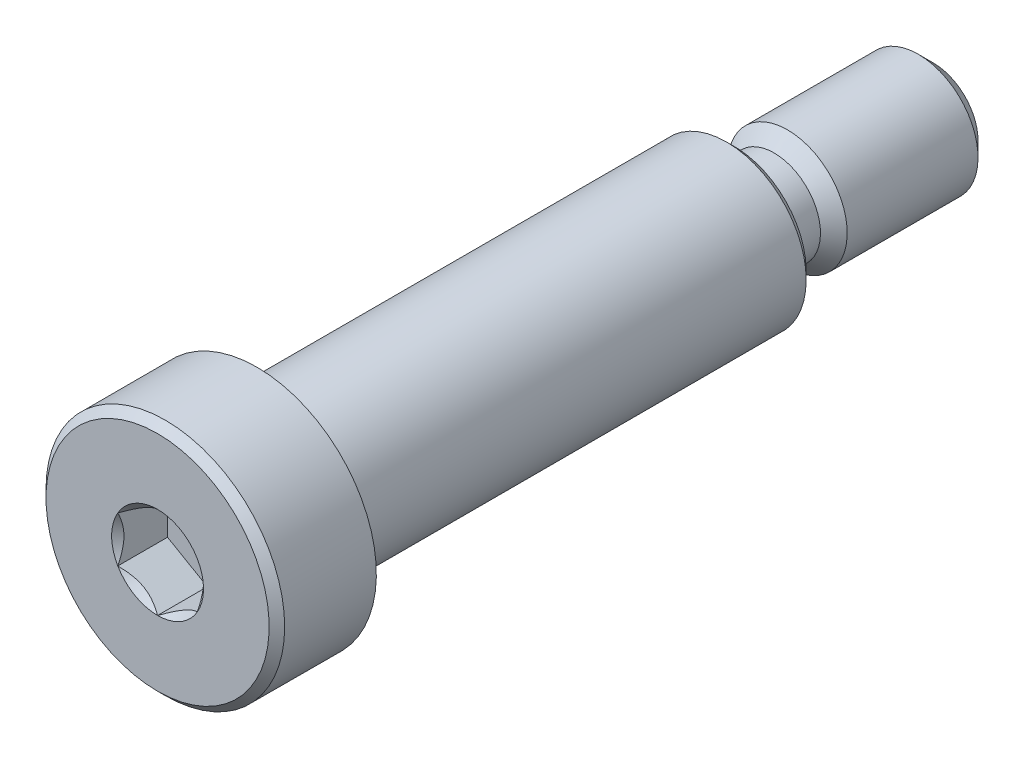
ISO-10303-21;
HEADER;
FILE_DESCRIPTION(('STEP AP214'),'2;1');
FILE_NAME('part.step','',(''),(''),'','','');
FILE_SCHEMA(('AUTOMOTIVE_DESIGN { 1 0 10303 214 1 1 1 1 }'));
ENDSEC;
DATA;
#1=APPLICATION_CONTEXT('core data for automotive mechanical design processes');
#2=APPLICATION_PROTOCOL_DEFINITION('international standard','automotive_design',2000,#1);
#3=PRODUCT_CONTEXT('',#1,'mechanical');
#4=PRODUCT('Part','Part','',(#3));
#5=PRODUCT_RELATED_PRODUCT_CATEGORY('part','',(#4));
#6=PRODUCT_DEFINITION_FORMATION('','',#4);
#7=PRODUCT_DEFINITION_CONTEXT('part definition',#1,'design');
#8=PRODUCT_DEFINITION('design','',#6,#7);
#9=PRODUCT_DEFINITION_SHAPE('','',#8);
#10=(LENGTH_UNIT() NAMED_UNIT(*) SI_UNIT(.MILLI.,.METRE.));
#11=(NAMED_UNIT(*) PLANE_ANGLE_UNIT() SI_UNIT($,.RADIAN.));
#12=(NAMED_UNIT(*) SI_UNIT($,.STERADIAN.) SOLID_ANGLE_UNIT());
#13=UNCERTAINTY_MEASURE_WITH_UNIT(LENGTH_MEASURE(1.E-05),#10,'distance_accuracy_value','');
#14=(GEOMETRIC_REPRESENTATION_CONTEXT(3) GLOBAL_UNCERTAINTY_ASSIGNED_CONTEXT((#13)) GLOBAL_UNIT_ASSIGNED_CONTEXT((#10,
#11,#12)) REPRESENTATION_CONTEXT('',''));
#15=CARTESIAN_POINT('',(0.,0.,0.));
#16=DIRECTION('',(0.,0.,1.));
#17=DIRECTION('',(1.,0.,0.));
#18=AXIS2_PLACEMENT_3D('',#15,#16,#17);
#19=CARTESIAN_POINT('',(0.,0.,0.));
#20=DIRECTION('',(0.,0.,1.));
#21=DIRECTION('',(0.,-1.,0.));
#22=AXIS2_PLACEMENT_3D('',#19,#20,#21);
#23=PLANE('',#22);
#24=CARTESIAN_POINT('',(0.,0.,0.));
#25=DIRECTION('',(0.,0.,1.));
#26=DIRECTION('',(1.,0.,0.));
#27=AXIS2_PLACEMENT_3D('',#24,#25,#26);
#28=CIRCLE('',#27,3.66617420935412);
#29=CARTESIAN_POINT('',(0.,-3.66617420935412,0.));
#30=VERTEX_POINT('',#29);
#31=CARTESIAN_POINT('',(3.175,-1.83308710467707,0.));
#32=VERTEX_POINT('',#31);
#33=EDGE_CURVE('E56',#30,#32,#28,.T.);
#34=ORIENTED_EDGE('',*,*,#33,.F.);
#35=CARTESIAN_POINT('',(-3.175,-1.83308710467706,0.));
#36=VERTEX_POINT('',#35);
#37=EDGE_CURVE('E63',#36,#30,#28,.T.);
#38=ORIENTED_EDGE('',*,*,#37,.F.);
#39=CARTESIAN_POINT('',(-3.175,1.83308710467706,0.));
#40=VERTEX_POINT('',#39);
#41=EDGE_CURVE('E136',#40,#36,#28,.T.);
#42=ORIENTED_EDGE('',*,*,#41,.F.);
#43=CARTESIAN_POINT('',(0.,3.66617420935412,0.));
#44=VERTEX_POINT('',#43);
#45=EDGE_CURVE('E131',#44,#40,#28,.T.);
#46=ORIENTED_EDGE('',*,*,#45,.F.);
#47=CARTESIAN_POINT('',(3.175,1.83308710467706,0.));
#48=VERTEX_POINT('',#47);
#49=EDGE_CURVE('E104',#48,#44,#28,.T.);
#50=ORIENTED_EDGE('',*,*,#49,.F.);
#51=EDGE_CURVE('E95',#32,#48,#28,.T.);
#52=ORIENTED_EDGE('',*,*,#51,.F.);
#53=EDGE_LOOP('',(#34,#38,#42,#46,#50,#52));
#54=FACE_BOUND('',#53,.T.);
#55=CARTESIAN_POINT('',(0.,0.,0.));
#56=DIRECTION('',(0.,0.,1.));
#57=DIRECTION('',(0.,-1.,0.));
#58=AXIS2_PLACEMENT_3D('',#55,#56,#57);
#59=CIRCLE('',#58,8.90587499999999);
#60=CARTESIAN_POINT('',(0.,-8.90587499999999,0.));
#61=VERTEX_POINT('',#60);
#62=EDGE_CURVE('E50',#61,#61,#59,.T.);
#63=ORIENTED_EDGE('',*,*,#62,.T.);
#64=EDGE_LOOP('',(#63));
#65=FACE_BOUND('',#64,.T.);
#66=ADVANCED_FACE('F36',(#54,#65),#23,.T.);
#67=CARTESIAN_POINT('',(0.,0.,-61.9125));
#68=DIRECTION('',(0.,0.,-1.));
#69=DIRECTION('',(0.,1.,0.));
#70=AXIS2_PLACEMENT_3D('',#67,#68,#69);
#71=CYLINDRICAL_SURFACE('',#70,9.525);
#72=CARTESIAN_POINT('',(0.,0.,-0.619125000000019));
#73=DIRECTION('',(0.,0.,1.));
#74=DIRECTION('',(0.,-1.,0.));
#75=AXIS2_PLACEMENT_3D('',#72,#73,#74);
#76=CIRCLE('',#75,9.525);
#77=CARTESIAN_POINT('',(0.,-9.525,-0.619125000000019));
#78=VERTEX_POINT('',#77);
#79=EDGE_CURVE('E228',#78,#78,#76,.F.);
#80=ORIENTED_EDGE('',*,*,#79,.T.);
#81=EDGE_LOOP('',(#80));
#82=FACE_BOUND('',#81,.T.);
#83=CARTESIAN_POINT('',(0.,0.,-7.93750000000001));
#84=DIRECTION('',(0.,0.,-1.));
#85=DIRECTION('',(0.,1.,0.));
#86=AXIS2_PLACEMENT_3D('',#83,#84,#85);
#87=CIRCLE('',#86,9.525);
#88=CARTESIAN_POINT('',(0.,9.525,-7.93750000000001));
#89=VERTEX_POINT('',#88);
#90=EDGE_CURVE('E243',#89,#89,#87,.T.);
#91=ORIENTED_EDGE('',*,*,#90,.F.);
#92=EDGE_LOOP('',(#91));
#93=FACE_BOUND('',#92,.T.);
#94=ADVANCED_FACE('F197',(#82,#93),#71,.T.);
#95=CARTESIAN_POINT('',(0.,-9.525,-7.93750000000001));
#96=DIRECTION('',(0.,0.,-1.));
#97=DIRECTION('',(0.,1.,0.));
#98=AXIS2_PLACEMENT_3D('',#95,#96,#97);
#99=PLANE('',#98);
#100=ORIENTED_EDGE('',*,*,#90,.T.);
#101=EDGE_LOOP('',(#100));
#102=FACE_BOUND('',#101,.T.);
#103=CARTESIAN_POINT('',(0.,0.,-7.93750000000001));
#104=DIRECTION('',(0.,0.,-1.));
#105=DIRECTION('',(0.,1.,0.));
#106=AXIS2_PLACEMENT_3D('',#103,#104,#105);
#107=CIRCLE('',#106,6.34999999999999);
#108=CARTESIAN_POINT('',(0.,6.34999999999999,-7.93750000000001));
#109=VERTEX_POINT('',#108);
#110=EDGE_CURVE('E245',#109,#109,#107,.T.);
#111=ORIENTED_EDGE('',*,*,#110,.F.);
#112=EDGE_LOOP('',(#111));
#113=FACE_BOUND('',#112,.T.);
#114=ADVANCED_FACE('F202',(#102,#113),#99,.T.);
#115=CARTESIAN_POINT('',(0.,0.,-61.9125));
#116=DIRECTION('',(0.,0.,-1.));
#117=DIRECTION('',(0.,1.,0.));
#118=AXIS2_PLACEMENT_3D('',#115,#116,#117);
#119=CYLINDRICAL_SURFACE('',#118,6.35);
#120=CARTESIAN_POINT('',(0.,0.,-45.418375));
#121=DIRECTION('',(0.,0.,-1.));
#122=DIRECTION('',(0.,1.,0.));
#123=AXIS2_PLACEMENT_3D('',#120,#121,#122);
#124=CIRCLE('',#123,6.35);
#125=CARTESIAN_POINT('',(0.,-6.34999999999999,-45.418375));
#126=VERTEX_POINT('',#125);
#127=EDGE_CURVE('E221',#126,#126,#124,.F.);
#128=ORIENTED_EDGE('',*,*,#127,.T.);
#129=EDGE_LOOP('',(#128));
#130=FACE_BOUND('',#129,.T.);
#131=ORIENTED_EDGE('',*,*,#110,.T.);
#132=EDGE_LOOP('',(#131));
#133=FACE_BOUND('',#132,.T.);
#134=ADVANCED_FACE('F346',(#130,#133),#119,.T.);
#135=CARTESIAN_POINT('',(0.,-6.35,-46.0375));
#136=DIRECTION('',(0.,0.,-1.));
#137=DIRECTION('',(0.,1.,0.));
#138=AXIS2_PLACEMENT_3D('',#135,#136,#137);
#139=PLANE('',#138);
#140=CARTESIAN_POINT('',(0.,0.,-46.0375));
#141=DIRECTION('',(0.,0.,-1.));
#142=DIRECTION('',(0.,1.,0.));
#143=AXIS2_PLACEMENT_3D('',#140,#141,#142);
#144=CIRCLE('',#143,5.73087499999999);
#145=CARTESIAN_POINT('',(0.,-5.73087499999998,-46.0375));
#146=VERTEX_POINT('',#145);
#147=EDGE_CURVE('E224',#146,#146,#144,.T.);
#148=ORIENTED_EDGE('',*,*,#147,.T.);
#149=EDGE_LOOP('',(#148));
#150=FACE_BOUND('',#149,.T.);
#151=CARTESIAN_POINT('',(0.,0.,-46.0375));
#152=DIRECTION('',(0.,0.,-1.));
#153=DIRECTION('',(0.,1.,0.));
#154=AXIS2_PLACEMENT_3D('',#151,#152,#153);
#155=CIRCLE('',#154,4.7625);
#156=CARTESIAN_POINT('',(0.,4.7625,-46.0375));
#157=VERTEX_POINT('',#156);
#158=EDGE_CURVE('E254',#157,#157,#155,.T.);
#159=ORIENTED_EDGE('',*,*,#158,.F.);
#160=EDGE_LOOP('',(#159));
#161=FACE_BOUND('',#160,.T.);
#162=ADVANCED_FACE('F353',(#150,#161),#139,.T.);
#163=CARTESIAN_POINT('',(0.,0.,-47.1043));
#164=DIRECTION('',(0.,0.,-1.));
#165=DIRECTION('',(0.,1.,0.));
#166=AXIS2_PLACEMENT_3D('',#163,#164,#165);
#167=TOROIDAL_SURFACE('',#166,4.7625,1.0668);
#168=CARTESIAN_POINT('',(0.,0.,-47.1043));
#169=DIRECTION('',(0.,0.,-1.));
#170=DIRECTION('',(0.,1.,0.));
#171=AXIS2_PLACEMENT_3D('',#168,#169,#170);
#172=CIRCLE('',#171,3.6957);
#173=CARTESIAN_POINT('',(0.,3.6957,-47.1043));
#174=VERTEX_POINT('',#173);
#175=EDGE_CURVE('E258',#174,#174,#172,.T.);
#176=ORIENTED_EDGE('',*,*,#175,.F.);
#177=EDGE_LOOP('',(#176));
#178=FACE_BOUND('',#177,.T.);
#179=ORIENTED_EDGE('',*,*,#158,.T.);
#180=EDGE_LOOP('',(#179));
#181=FACE_BOUND('',#180,.T.);
#182=ADVANCED_FACE('F361',(#178,#181),#167,.F.);
#183=CARTESIAN_POINT('',(0.,0.,-61.9125));
#184=DIRECTION('',(0.,0.,-1.));
#185=DIRECTION('',(0.,1.,0.));
#186=AXIS2_PLACEMENT_3D('',#183,#184,#185);
#187=CYLINDRICAL_SURFACE('',#186,3.6957);
#188=CARTESIAN_POINT('',(0.,0.,-49.2125));
#189=DIRECTION('',(0.,0.,-1.));
#190=DIRECTION('',(0.,1.,0.));
#191=AXIS2_PLACEMENT_3D('',#188,#189,#190);
#192=CIRCLE('',#191,3.6957);
#193=CARTESIAN_POINT('',(0.,3.6957,-49.2125));
#194=VERTEX_POINT('',#193);
#195=EDGE_CURVE('E262',#194,#194,#192,.T.);
#196=ORIENTED_EDGE('',*,*,#195,.F.);
#197=EDGE_LOOP('',(#196));
#198=FACE_BOUND('',#197,.T.);
#199=ORIENTED_EDGE('',*,*,#175,.T.);
#200=EDGE_LOOP('',(#199));
#201=FACE_BOUND('',#200,.T.);
#202=ADVANCED_FACE('F387',(#198,#201),#187,.T.);
#203=CARTESIAN_POINT('',(0.,0.,-49.2125));
#204=DIRECTION('',(0.,0.,-1.));
#205=DIRECTION('',(0.,1.,0.));
#206=AXIS2_PLACEMENT_3D('',#203,#204,#205);
#207=CONICAL_SURFACE('',#206,3.6957,0.785398163397443);
#208=CARTESIAN_POINT('',(0.,0.,-50.2793));
#209=DIRECTION('',(0.,0.,-1.));
#210=DIRECTION('',(0.,1.,0.));
#211=AXIS2_PLACEMENT_3D('',#208,#209,#210);
#212=CIRCLE('',#211,4.7625);
#213=CARTESIAN_POINT('',(0.,4.7625,-50.2793));
#214=VERTEX_POINT('',#213);
#215=EDGE_CURVE('E249',#214,#214,#212,.F.);
#216=ORIENTED_EDGE('',*,*,#215,.T.);
#217=EDGE_LOOP('',(#216));
#218=FACE_BOUND('',#217,.T.);
#219=ORIENTED_EDGE('',*,*,#195,.T.);
#220=EDGE_LOOP('',(#219));
#221=FACE_BOUND('',#220,.T.);
#222=ADVANCED_FACE('F378',(#218,#221),#207,.T.);
#223=CARTESIAN_POINT('',(0.,-4.7625,-61.9125));
#224=DIRECTION('',(0.,0.,-1.));
#225=DIRECTION('',(0.,1.,0.));
#226=AXIS2_PLACEMENT_3D('',#223,#224,#225);
#227=PLANE('',#226);
#228=CARTESIAN_POINT('',(0.,0.,-61.9125));
#229=DIRECTION('',(0.,0.,-1.));
#230=DIRECTION('',(0.,1.,0.));
#231=AXIS2_PLACEMENT_3D('',#228,#229,#230);
#232=CIRCLE('',#231,3.57187500000002);
#233=CARTESIAN_POINT('',(0.,3.57187500000002,-61.9125));
#234=VERTEX_POINT('',#233);
#235=EDGE_CURVE('E231',#234,#234,#232,.T.);
#236=ORIENTED_EDGE('',*,*,#235,.T.);
#237=EDGE_LOOP('',(#236));
#238=FACE_BOUND('',#237,.T.);
#239=ADVANCED_FACE('F369',(#238),#227,.T.);
#240=CARTESIAN_POINT('',(0.,0.,-61.9125));
#241=DIRECTION('',(0.,0.,-1.));
#242=DIRECTION('',(0.,1.,0.));
#243=AXIS2_PLACEMENT_3D('',#240,#241,#242);
#244=CYLINDRICAL_SURFACE('',#243,4.7625);
#245=CARTESIAN_POINT('',(0.,0.,-60.721875));
#246=DIRECTION('',(0.,0.,-1.));
#247=DIRECTION('',(0.,1.,0.));
#248=AXIS2_PLACEMENT_3D('',#245,#246,#247);
#249=CIRCLE('',#248,4.7625);
#250=CARTESIAN_POINT('',(0.,4.7625,-60.721875));
#251=VERTEX_POINT('',#250);
#252=EDGE_CURVE('E226',#251,#251,#249,.F.);
#253=ORIENTED_EDGE('',*,*,#252,.T.);
#254=EDGE_LOOP('',(#253));
#255=FACE_BOUND('',#254,.T.);
#256=ORIENTED_EDGE('',*,*,#215,.F.);
#257=EDGE_LOOP('',(#256));
#258=FACE_BOUND('',#257,.T.);
#259=ADVANCED_FACE('F210',(#255,#258),#244,.T.);
#260=CARTESIAN_POINT('',(0.,0.,-61.9125));
#261=DIRECTION('',(0.,0.,1.));
#262=DIRECTION('',(0.,-1.,0.));
#263=AXIS2_PLACEMENT_3D('',#260,#261,#262);
#264=CONICAL_SURFACE('',#263,3.57187500000002,0.785398163397442);
#265=ORIENTED_EDGE('',*,*,#252,.F.);
#266=EDGE_LOOP('',(#265));
#267=FACE_BOUND('',#266,.T.);
#268=ORIENTED_EDGE('',*,*,#235,.F.);
#269=EDGE_LOOP('',(#268));
#270=FACE_BOUND('',#269,.T.);
#271=ADVANCED_FACE('F207',(#267,#270),#264,.T.);
#272=CARTESIAN_POINT('',(0.,0.,-46.0375));
#273=DIRECTION('',(0.,0.,1.));
#274=DIRECTION('',(0.,-1.,0.));
#275=AXIS2_PLACEMENT_3D('',#272,#273,#274);
#276=CONICAL_SURFACE('',#275,5.73087499999999,0.78539816339745);
#277=CARTESIAN_POINT('',(0.,-6.34999999999999,-45.418375));
#278=CARTESIAN_POINT('',(0.,-6.34355078124999,-45.42482421875));
#279=CARTESIAN_POINT('',(0.,-6.33710156249999,-45.4312734375));
#280=CARTESIAN_POINT('',(0.,-6.32420312499999,-45.444171875));
#281=CARTESIAN_POINT('',(0.,-6.31775390624999,-45.45062109375));
#282=CARTESIAN_POINT('',(0.,-6.30485546874999,-45.46351953125));
#283=CARTESIAN_POINT('',(0.,-6.29840624999999,-45.46996875));
#284=CARTESIAN_POINT('',(0.,-6.28550781249999,-45.4828671875));
#285=CARTESIAN_POINT('',(0.,-6.27905859374999,-45.48931640625));
#286=CARTESIAN_POINT('',(0.,-6.26616015624999,-45.50221484375));
#287=CARTESIAN_POINT('',(0.,-6.25971093749999,-45.5086640625));
#288=CARTESIAN_POINT('',(0.,-6.24681249999999,-45.5215625));
#289=CARTESIAN_POINT('',(0.,-6.24036328124999,-45.52801171875));
#290=CARTESIAN_POINT('',(0.,-6.22746484374999,-45.54091015625));
#291=CARTESIAN_POINT('',(0.,-6.22101562499999,-45.547359375));
#292=CARTESIAN_POINT('',(0.,-6.20811718749999,-45.5602578125));
#293=CARTESIAN_POINT('',(0.,-6.20166796874999,-45.56670703125));
#294=CARTESIAN_POINT('',(0.,-6.18876953124999,-45.57960546875));
#295=CARTESIAN_POINT('',(0.,-6.18232031249999,-45.5860546875));
#296=CARTESIAN_POINT('',(0.,-6.16942187499999,-45.598953125));
#297=CARTESIAN_POINT('',(0.,-6.16297265624999,-45.60540234375));
#298=CARTESIAN_POINT('',(0.,-6.15007421874999,-45.61830078125));
#299=CARTESIAN_POINT('',(0.,-6.14362499999999,-45.62475));
#300=CARTESIAN_POINT('',(0.,-6.13072656249999,-45.6376484375));
#301=CARTESIAN_POINT('',(0.,-6.12427734374999,-45.64409765625));
#302=CARTESIAN_POINT('',(0.,-6.11137890624999,-45.65699609375));
#303=CARTESIAN_POINT('',(0.,-6.10492968749999,-45.6634453125));
#304=CARTESIAN_POINT('',(0.,-6.09203124999999,-45.67634375));
#305=CARTESIAN_POINT('',(0.,-6.08558203124999,-45.68279296875));
#306=CARTESIAN_POINT('',(0.,-6.07268359374999,-45.69569140625));
#307=CARTESIAN_POINT('',(0.,-6.06623437499999,-45.702140625));
#308=CARTESIAN_POINT('',(0.,-6.05333593749999,-45.7150390625));
#309=CARTESIAN_POINT('',(0.,-6.04688671874999,-45.72148828125));
#310=CARTESIAN_POINT('',(0.,-6.03398828124999,-45.73438671875));
#311=CARTESIAN_POINT('',(0.,-6.02753906249999,-45.7408359375));
#312=CARTESIAN_POINT('',(0.,-6.01464062499999,-45.753734375));
#313=CARTESIAN_POINT('',(0.,-6.00819140624999,-45.76018359375));
#314=CARTESIAN_POINT('',(0.,-5.99529296874999,-45.77308203125));
#315=CARTESIAN_POINT('',(0.,-5.98884374999998,-45.77953125));
#316=CARTESIAN_POINT('',(0.,-5.97594531249998,-45.7924296875));
#317=CARTESIAN_POINT('',(0.,-5.96949609374999,-45.79887890625));
#318=CARTESIAN_POINT('',(0.,-5.95659765624999,-45.81177734375));
#319=CARTESIAN_POINT('',(0.,-5.95014843749999,-45.8182265625));
#320=CARTESIAN_POINT('',(0.,-5.93724999999999,-45.831125));
#321=CARTESIAN_POINT('',(0.,-5.93080078124999,-45.83757421875));
#322=CARTESIAN_POINT('',(0.,-5.91790234374998,-45.85047265625));
#323=CARTESIAN_POINT('',(0.,-5.91145312499998,-45.856921875));
#324=CARTESIAN_POINT('',(0.,-5.89855468749998,-45.8698203125));
#325=CARTESIAN_POINT('',(0.,-5.89210546874998,-45.87626953125));
#326=CARTESIAN_POINT('',(0.,-5.87920703124998,-45.88916796875));
#327=CARTESIAN_POINT('',(0.,-5.87275781249998,-45.8956171875));
#328=CARTESIAN_POINT('',(0.,-5.85985937499998,-45.908515625));
#329=CARTESIAN_POINT('',(0.,-5.85341015624998,-45.91496484375));
#330=CARTESIAN_POINT('',(0.,-5.84051171874998,-45.92786328125));
#331=CARTESIAN_POINT('',(0.,-5.83406249999998,-45.9343125));
#332=CARTESIAN_POINT('',(0.,-5.82116406249998,-45.9472109375));
#333=CARTESIAN_POINT('',(0.,-5.81471484374998,-45.95366015625));
#334=CARTESIAN_POINT('',(0.,-5.80181640624998,-45.96655859375));
#335=CARTESIAN_POINT('',(0.,-5.79536718749998,-45.9730078125));
#336=CARTESIAN_POINT('',(0.,-5.78246874999998,-45.98590625));
#337=CARTESIAN_POINT('',(0.,-5.77601953124998,-45.99235546875));
#338=CARTESIAN_POINT('',(0.,-5.76312109374998,-46.00525390625));
#339=CARTESIAN_POINT('',(0.,-5.75667187499998,-46.011703125));
#340=CARTESIAN_POINT('',(0.,-5.74377343749998,-46.0246015625));
#341=CARTESIAN_POINT('',(0.,-5.73732421874998,-46.03105078125));
#342=CARTESIAN_POINT('',(0.,-5.73087499999998,-46.0375));
#343=B_SPLINE_CURVE_WITH_KNOTS('',3,(#277,#278,#279,#280,#281,#282,#283,#284,#285,#286,#287,
#288,#289,#290,#291,#292,#293,#294,#295,#296,#297,#298,#299,#300,#301,#302,#303,#304,#305,#306,
#307,#308,#309,#310,#311,#312,#313,#314,#315,#316,#317,#318,#319,#320,#321,#322,#323,#324,#325,
#326,#327,#328,#329,#330,#331,#332,#333,#334,#335,#336,#337,#338,#339,#340,#341,#342),
.UNSPECIFIED.,.F.,.F.,(4,2,2,2,2,2,2,2,2,2,2,2,2,2,2,2,2,2,2,2,2,2,2,2,2,2,2,2,2,2,2,2,4),(0.,
0.0273617178688837,0.0547234357377674,0.0820851536066518,0.109446871475536,0.136808589344414,
0.164170307213299,0.191532025082182,0.218893742951066,0.24625546081995,0.273617178688829,
0.300978896557713,0.328340614426597,0.355702332295481,0.38306405016436,0.410425768033244,
0.437787485902128,0.465149203771012,0.492510921639895,0.519872639508775,0.547234357377659,
0.574596075246542,0.601957793115427,0.629319510984305,0.656681228853189,0.684042946722074,
0.711404664590957,0.738766382459841,0.76612810032872,0.793489818197604,0.820851536066488,
0.848213253935372,0.875574971804251),.UNSPECIFIED.);
#344=EDGE_CURVE('BSEAM209',#126,#146,#343,.T.);
#345=ORIENTED_EDGE('',*,*,#127,.F.);
#346=ORIENTED_EDGE('',*,*,#147,.F.);
#347=ORIENTED_EDGE('',*,*,#344,.T.);
#348=ORIENTED_EDGE('',*,*,#344,.F.);
#349=EDGE_LOOP('',(#345,#347,#346,#348));
#350=FACE_BOUND('',#349,.T.);
#351=ADVANCED_FACE('F209',(#350),#276,.T.);
#352=CARTESIAN_POINT('',(0.,0.,-0.619125000000019));
#353=DIRECTION('',(0.,0.,-1.));
#354=DIRECTION('',(0.,1.,0.));
#355=AXIS2_PLACEMENT_3D('',#352,#353,#354);
#356=CONICAL_SURFACE('',#355,9.525,0.785398163397443);
#357=ORIENTED_EDGE('',*,*,#62,.F.);
#358=EDGE_LOOP('',(#357));
#359=FACE_BOUND('',#358,.T.);
#360=ORIENTED_EDGE('',*,*,#79,.F.);
#361=EDGE_LOOP('',(#360));
#362=FACE_BOUND('',#361,.T.);
#363=ADVANCED_FACE('F38',(#359,#362),#356,.T.);
#364=CARTESIAN_POINT('',(0.,0.,0.));
#365=DIRECTION('',(0.,0.,1.));
#366=DIRECTION('',(1.,0.,0.));
#367=AXIS2_PLACEMENT_3D('',#364,#365,#366);
#368=CONICAL_SURFACE('',#367,3.66617420935412,0.78539816339745);
#369=ORIENTED_EDGE('',*,*,#49,.T.);
#370=CARTESIAN_POINT('',(3.1752,1.83297163462322,0.000115475508944067));
#371=CARTESIAN_POINT('',(3.06606165005017,1.89598269034567,-0.0628410163082169));
#372=CARTESIAN_POINT('',(2.95509837192206,1.9600473688431,-0.122099895765255));
#373=CARTESIAN_POINT('',(2.72883215365405,2.09068223086865,-0.230601344269443));
#374=CARTESIAN_POINT('',(2.61350769674774,2.15726483710766,-0.279783546061288));
#375=CARTESIAN_POINT('',(2.38096147751938,2.29152545937818,-0.364033541125997));
#376=CARTESIAN_POINT('',(2.26379893371885,2.35916928558036,-0.399313085500551));
#377=CARTESIAN_POINT('',(2.02689455535372,2.49594609220167,-0.45366842986518));
#378=CARTESIAN_POINT('',(1.90715995735645,2.5650748945867,-0.47278480247036));
#379=CARTESIAN_POINT('',(1.70080208124842,2.68421566990707,-0.490032869376752));
#380=CARTESIAN_POINT('',(1.61444529227085,2.73407378526963,-0.492586066386179));
#381=CARTESIAN_POINT('',(1.44187218347529,2.83370891608763,-0.488283726876735));
#382=CARTESIAN_POINT('',(1.3556559235072,2.88348589698873,-0.481424891978556));
#383=CARTESIAN_POINT('',(1.18404020841287,2.98256827629561,-0.4586901166963));
#384=CARTESIAN_POINT('',(1.09864177574673,3.03187308438378,-0.442804090312722));
#385=CARTESIAN_POINT('',(0.929311596694528,3.1296359088415,-0.402882016002049));
#386=CARTESIAN_POINT('',(0.845379738380253,3.17809398983283,-0.37884659291483));
#387=CARTESIAN_POINT('',(0.696376420715886,3.2641210953965,-0.329394765582835));
#388=CARTESIAN_POINT('',(0.630975148808269,3.30188053733771,-0.305278280699013));
#389=CARTESIAN_POINT('',(0.501346749794894,3.3767215284027,-0.253158532862845));
#390=CARTESIAN_POINT('',(0.437119658558277,3.41380305681743,-0.225155151396475));
#391=CARTESIAN_POINT('',(0.3100419654874,3.48717139711989,-0.165889434455491));
#392=CARTESIAN_POINT('',(0.247187749251276,3.52346029578352,-0.134637346645791));
#393=CARTESIAN_POINT('',(0.122643379151907,3.59536602138644,-0.0692846556080675));
#394=CARTESIAN_POINT('',(0.0609525390212909,3.63098324454239,-0.0351858004814551));
#395=CARTESIAN_POINT('',(-0.000199999999999575,3.66628967940796,0.000115475508943787));
#396=B_SPLINE_CURVE_WITH_KNOTS('',3,(#370,#371,#372,#373,#374,#375,#376,#377,#378,#379,#380,
#381,#382,#383,#384,#385,#386,#387,#388,#389,#390,#391,#392,#393,#394,#395),.UNSPECIFIED.,.F.,
.F.,(4,2,2,2,2,2,2,2,2,2,2,2,4),(0.,0.422910572436808,0.848285055427807,1.26690402276127,
1.68446903107506,1.98329272958351,2.2822211754689,2.58148426995465,2.88072442418452,
3.11844134429546,3.35616551414405,3.59316134346767,3.8300126974443),.UNSPECIFIED.);
#397=EDGE_CURVE('E11',#48,#44,#396,.T.);
#398=ORIENTED_EDGE('',*,*,#397,.F.);
#399=EDGE_LOOP('',(#369,#398));
#400=FACE_BOUND('',#399,.T.);
#401=ADVANCED_FACE('F107',(#400),#368,.F.);
#402=ORIENTED_EDGE('',*,*,#45,.T.);
#403=CARTESIAN_POINT('',(0.000200000000000467,3.66628967940796,0.000115475508943935));
#404=CARTESIAN_POINT('',(-0.108938349949825,3.60327862368552,-0.0628410163082174));
#405=CARTESIAN_POINT('',(-0.219901628077944,3.53921394518809,-0.122099895765256));
#406=CARTESIAN_POINT('',(-0.446167846345946,3.40857908316254,-0.230601344269443));
#407=CARTESIAN_POINT('',(-0.561492303252261,3.34199647692353,-0.279783546061287));
#408=CARTESIAN_POINT('',(-0.794038522480624,3.207735854653,-0.364033541125996));
#409=CARTESIAN_POINT('',(-0.911201066281148,3.14009202845083,-0.39931308550055));
#410=CARTESIAN_POINT('',(-1.14810544464628,3.00331522182952,-0.453668429865179));
#411=CARTESIAN_POINT('',(-1.26784004264355,2.93418641944448,-0.47278480247036));
#412=CARTESIAN_POINT('',(-1.47419791875158,2.81504564412411,-0.490032869376752));
#413=CARTESIAN_POINT('',(-1.56055470772915,2.76518752876156,-0.492586066386179));
#414=CARTESIAN_POINT('',(-1.73312781652471,2.66555239794355,-0.488283726876735));
#415=CARTESIAN_POINT('',(-1.8193440764928,2.61577541704245,-0.481424891978555));
#416=CARTESIAN_POINT('',(-1.99095979158713,2.51669303773558,-0.458690116696299));
#417=CARTESIAN_POINT('',(-2.07635822425327,2.4673882296474,-0.442804090312722));
#418=CARTESIAN_POINT('',(-2.24568840330547,2.36962540518969,-0.402882016002048));
#419=CARTESIAN_POINT('',(-2.32962026161975,2.32116732419836,-0.37884659291483));
#420=CARTESIAN_POINT('',(-2.47862357928411,2.23514021863469,-0.329394765582835));
#421=CARTESIAN_POINT('',(-2.54402485119173,2.19738077669348,-0.305278280699012));
#422=CARTESIAN_POINT('',(-2.67365325020511,2.12253978562849,-0.253158532862845));
#423=CARTESIAN_POINT('',(-2.73788034144172,2.08545825721376,-0.225155151396475));
#424=CARTESIAN_POINT('',(-2.8649580345126,2.01208991691129,-0.165889434455491));
#425=CARTESIAN_POINT('',(-2.92781225074872,1.97580101824767,-0.134637346645791));
#426=CARTESIAN_POINT('',(-3.05235662084809,1.90389529264474,-0.0692846556080678));
#427=CARTESIAN_POINT('',(-3.11404746097871,1.8682780694888,-0.0351858004814554));
#428=CARTESIAN_POINT('',(-3.1752,1.83297163462323,0.000115475508943606));
#429=B_SPLINE_CURVE_WITH_KNOTS('',3,(#403,#404,#405,#406,#407,#408,#409,#410,#411,#412,#413,
#414,#415,#416,#417,#418,#419,#420,#421,#422,#423,#424,#425,#426,#427,#428),.UNSPECIFIED.,.F.,
.F.,(4,2,2,2,2,2,2,2,2,2,2,2,4),(0.,0.422910572436808,0.848285055427807,1.26690402276127,
1.68446903107506,1.98329272958351,2.2822211754689,2.58148426995465,2.88072442418451,
3.11844134429546,3.35616551414405,3.59316134346766,3.8300126974443),.UNSPECIFIED.);
#430=EDGE_CURVE('E132',#44,#40,#429,.T.);
#431=ORIENTED_EDGE('',*,*,#430,.F.);
#432=EDGE_LOOP('',(#402,#431));
#433=FACE_BOUND('',#432,.T.);
#434=ADVANCED_FACE('F299',(#433),#368,.F.);
#435=ORIENTED_EDGE('',*,*,#41,.T.);
#436=CARTESIAN_POINT('',(-3.175,-3.65592387452516,1.17597452610651));
#437=CARTESIAN_POINT('',(-3.175,-3.56690614739902,1.10877955728795));
#438=CARTESIAN_POINT('',(-3.175,-3.47739001482927,1.04223411677949));
#439=CARTESIAN_POINT('',(-3.175,-3.29716433407819,0.910733107989));
#440=CARTESIAN_POINT('',(-3.175,-3.20645449195236,0.8457779430093));
#441=CARTESIAN_POINT('',(-3.175,-3.02298124672425,0.717286472588262));
#442=CARTESIAN_POINT('',(-3.175,-2.93020737789476,0.653765060519482));
#443=CARTESIAN_POINT('',(-3.175,-2.74308490461527,0.529093231239513));
#444=CARTESIAN_POINT('',(-3.175,-2.64873641209623,0.467942646518007));
#445=CARTESIAN_POINT('',(-3.175,-2.45276910629102,0.345127291468585));
#446=CARTESIAN_POINT('',(-3.175,-2.35104296923552,0.283632900035067));
#447=CARTESIAN_POINT('',(-3.175,-2.14521620329061,0.164690024110211));
#448=CARTESIAN_POINT('',(-3.175,-2.04111520164361,0.107242180628362));
#449=CARTESIAN_POINT('',(-3.175,-1.8305483898592,-0.00236807378855735));
#450=CARTESIAN_POINT('',(-3.175,-1.72409073387149,-0.05454602658689));
#451=CARTESIAN_POINT('',(-3.175,-1.50827203793058,-0.152448430174923));
#452=CARTESIAN_POINT('',(-3.175,-1.39891233941784,-0.198175803007057));
#453=CARTESIAN_POINT('',(-3.175,-1.18604701054559,-0.278193824629251));
#454=CARTESIAN_POINT('',(-3.175,-1.08277848917347,-0.313108695034414));
#455=CARTESIAN_POINT('',(-3.175,-0.873755153890324,-0.374653665073786));
#456=CARTESIAN_POINT('',(-3.175,-0.768000169236097,-0.401283193963396));
#457=CARTESIAN_POINT('',(-3.175,-0.556394353071963,-0.444423804951883));
#458=CARTESIAN_POINT('',(-3.175,-0.450579451492892,-0.461108250420231));
#459=CARTESIAN_POINT('',(-3.175,-0.237818454981045,-0.484034858218018));
#460=CARTESIAN_POINT('',(-3.175,-0.130872557680108,-0.49027881555587));
#461=CARTESIAN_POINT('',(-3.175,0.0792250150830045,-0.491860727197653));
#462=CARTESIAN_POINT('',(-3.175,0.18237391199382,-0.487585251998013));
#463=CARTESIAN_POINT('',(-3.175,0.387788153537299,-0.469217325011947));
#464=CARTESIAN_POINT('',(-3.175,0.490053411359905,-0.455123919552885));
#465=CARTESIAN_POINT('',(-3.175,0.694689208906974,-0.417649304806497));
#466=CARTESIAN_POINT('',(-3.175,0.797030337701614,-0.394110040645698));
#467=CARTESIAN_POINT('',(-3.175,0.999482692253839,-0.3389990990408));
#468=CARTESIAN_POINT('',(-3.175,1.09959410383402,-0.307428093699382));
#469=CARTESIAN_POINT('',(-3.175,1.30666025401972,-0.234302973381313));
#470=CARTESIAN_POINT('',(-3.175,1.41338058113121,-0.192091761298271));
#471=CARTESIAN_POINT('',(-3.175,1.62403512608011,-0.101194633675295));
#472=CARTESIAN_POINT('',(-3.175,1.72796839622315,-0.0525065484982067));
#473=CARTESIAN_POINT('',(-3.175,1.93357808805447,0.0501937756761229));
#474=CARTESIAN_POINT('',(-3.175,2.03524592560239,0.104223062169345));
#475=CARTESIAN_POINT('',(-3.175,2.23624195707291,0.216408901364748));
#476=CARTESIAN_POINT('',(-3.175,2.3355705197654,0.274564797656881));
#477=CARTESIAN_POINT('',(-3.175,2.52730642275902,0.391215115503931));
#478=CARTESIAN_POINT('',(-3.175,2.61981218330511,0.449548619193316));
#479=CARTESIAN_POINT('',(-3.175,2.80323560367684,0.568668649469825));
#480=CARTESIAN_POINT('',(-3.175,2.89415314246283,0.629455361859399));
#481=CARTESIAN_POINT('',(-3.175,3.07387072487129,0.752541216482857));
#482=CARTESIAN_POINT('',(-3.175,3.16268196996071,0.814824062049374));
#483=CARTESIAN_POINT('',(-3.175,3.33909075370388,0.941036832486232));
#484=CARTESIAN_POINT('',(-3.175,3.42668861940902,1.00496629970184));
#485=CARTESIAN_POINT('',(-3.175,3.51377838474595,1.06956897805668));
#486=B_SPLINE_CURVE_WITH_KNOTS('',3,(#436,#437,#438,#439,#440,#441,#442,#443,#444,#445,#446,
#447,#448,#449,#450,#451,#452,#453,#454,#455,#456,#457,#458,#459,#460,#461,#462,#463,#464,#465,
#466,#467,#468,#469,#470,#471,#472,#473,#474,#475,#476,#477,#478,#479,#480,#481,#482,#483,#484,
#485),.UNSPECIFIED.,.F.,.F.,(4,2,2,2,2,2,2,2,2,2,2,2,2,2,2,2,2,2,2,2,2,2,2,2,4),(0.,
0.334601712013315,0.669287419770511,1.00656636796479,1.3438214421939,1.70035269072413,
2.05694029057745,2.41244349871029,2.76778514705124,3.09453137075717,3.42130009774479,
3.74219200698696,4.06302874036785,4.37225254917033,4.68150639886781,4.99616636831742,
5.31080001541914,5.65482708645254,5.99896969199844,6.34424851858142,6.68947254507109,
7.01751396994993,7.34558028700741,7.67098168170701,7.99629359145139),.UNSPECIFIED.);
#487=EDGE_CURVE('E134',#40,#36,#486,.F.);
#488=ORIENTED_EDGE('',*,*,#487,.F.);
#489=EDGE_LOOP('',(#435,#488));
#490=FACE_BOUND('',#489,.T.);
#491=ADVANCED_FACE('F296',(#490),#368,.F.);
#492=ORIENTED_EDGE('',*,*,#37,.T.);
#493=CARTESIAN_POINT('',(-3.1752,-1.83297163462322,0.000115475508942766));
#494=CARTESIAN_POINT('',(-3.06606165005017,-1.89598269034567,-0.0628410163082177));
#495=CARTESIAN_POINT('',(-2.95509837192205,-1.9600473688431,-0.122099895765256));
#496=CARTESIAN_POINT('',(-2.72883215365405,-2.09068223086865,-0.230601344269444));
#497=CARTESIAN_POINT('',(-2.61350769674774,-2.15726483710766,-0.279783546061288));
#498=CARTESIAN_POINT('',(-2.38096147751938,-2.29152545937818,-0.364033541125997));
#499=CARTESIAN_POINT('',(-2.26379893371885,-2.35916928558036,-0.39931308550055));
#500=CARTESIAN_POINT('',(-2.02689455535372,-2.49594609220167,-0.453668429865179));
#501=CARTESIAN_POINT('',(-1.90715995735645,-2.5650748945867,-0.47278480247036));
#502=CARTESIAN_POINT('',(-1.70080208124842,-2.68421566990707,-0.490032869376752));
#503=CARTESIAN_POINT('',(-1.61444529227085,-2.73407378526963,-0.492586066386179));
#504=CARTESIAN_POINT('',(-1.44187218347529,-2.83370891608763,-0.488283726876735));
#505=CARTESIAN_POINT('',(-1.3556559235072,-2.88348589698873,-0.481424891978556));
#506=CARTESIAN_POINT('',(-1.18404020841287,-2.98256827629561,-0.4586901166963));
#507=CARTESIAN_POINT('',(-1.09864177574673,-3.03187308438378,-0.442804090312722));
#508=CARTESIAN_POINT('',(-0.929311596694529,-3.1296359088415,-0.402882016002049));
#509=CARTESIAN_POINT('',(-0.845379738380255,-3.17809398983283,-0.37884659291483));
#510=CARTESIAN_POINT('',(-0.696376420715887,-3.2641210953965,-0.329394765582836));
#511=CARTESIAN_POINT('',(-0.63097514880827,-3.3018805373377,-0.305278280699013));
#512=CARTESIAN_POINT('',(-0.501346749794894,-3.3767215284027,-0.253158532862846));
#513=CARTESIAN_POINT('',(-0.437119658558277,-3.41380305681742,-0.225155151396475));
#514=CARTESIAN_POINT('',(-0.3100419654874,-3.48717139711989,-0.165889434455491));
#515=CARTESIAN_POINT('',(-0.247187749251276,-3.52346029578352,-0.134637346645791));
#516=CARTESIAN_POINT('',(-0.122643379151907,-3.59536602138645,-0.0692846556080672));
#517=CARTESIAN_POINT('',(-0.0609525390212904,-3.63098324454239,-0.0351858004814547));
#518=CARTESIAN_POINT('',(0.000200000000000515,-3.66628967940796,0.000115475508944399));
#519=B_SPLINE_CURVE_WITH_KNOTS('',3,(#493,#494,#495,#496,#497,#498,#499,#500,#501,#502,#503,
#504,#505,#506,#507,#508,#509,#510,#511,#512,#513,#514,#515,#516,#517,#518),.UNSPECIFIED.,.F.,
.F.,(4,2,2,2,2,2,2,2,2,2,2,2,4),(0.,0.422910572436807,0.848285055427805,1.26690402276127,
1.68446903107506,1.98329272958351,2.2822211754689,2.58148426995465,2.88072442418451,
3.11844134429546,3.35616551414405,3.59316134346766,3.8300126974443),.UNSPECIFIED.);
#520=EDGE_CURVE('E162',#36,#30,#519,.T.);
#521=ORIENTED_EDGE('',*,*,#520,.F.);
#522=EDGE_LOOP('',(#492,#521));
#523=FACE_BOUND('',#522,.T.);
#524=ADVANCED_FACE('F305',(#523),#368,.F.);
#525=ORIENTED_EDGE('',*,*,#33,.T.);
#526=CARTESIAN_POINT('',(-0.000199999999999559,-3.66628967940796,0.000115475508944369));
#527=CARTESIAN_POINT('',(0.108938349949826,-3.60327862368552,-0.0628410163082168));
#528=CARTESIAN_POINT('',(0.219901628077945,-3.53921394518809,-0.122099895765255));
#529=CARTESIAN_POINT('',(0.446167846345946,-3.40857908316254,-0.230601344269443));
#530=CARTESIAN_POINT('',(0.561492303252262,-3.34199647692353,-0.279783546061287));
#531=CARTESIAN_POINT('',(0.794038522480625,-3.207735854653,-0.364033541125995));
#532=CARTESIAN_POINT('',(0.911201066281148,-3.14009202845083,-0.399313085500549));
#533=CARTESIAN_POINT('',(1.14810544464628,-3.00331522182952,-0.453668429865179));
#534=CARTESIAN_POINT('',(1.26784004264355,-2.93418641944448,-0.472784802470359));
#535=CARTESIAN_POINT('',(1.47419791875158,-2.81504564412412,-0.490032869376751));
#536=CARTESIAN_POINT('',(1.56055470772915,-2.76518752876156,-0.492586066386178));
#537=CARTESIAN_POINT('',(1.73312781652471,-2.66555239794355,-0.488283726876734));
#538=CARTESIAN_POINT('',(1.8193440764928,-2.61577541704246,-0.481424891978554));
#539=CARTESIAN_POINT('',(1.99095979158713,-2.51669303773558,-0.458690116696299));
#540=CARTESIAN_POINT('',(2.07635822425327,-2.46738822964741,-0.442804090312722));
#541=CARTESIAN_POINT('',(2.24568840330547,-2.36962540518969,-0.402882016002048));
#542=CARTESIAN_POINT('',(2.32962026161975,-2.32116732419836,-0.378846592914829));
#543=CARTESIAN_POINT('',(2.47862357928411,-2.23514021863469,-0.329394765582835));
#544=CARTESIAN_POINT('',(2.54402485119173,-2.19738077669348,-0.305278280699012));
#545=CARTESIAN_POINT('',(2.67365325020511,-2.12253978562849,-0.253158532862845));
#546=CARTESIAN_POINT('',(2.73788034144172,-2.08545825721376,-0.225155151396474));
#547=CARTESIAN_POINT('',(2.8649580345126,-2.01208991691129,-0.165889434455489));
#548=CARTESIAN_POINT('',(2.92781225074872,-1.97580101824767,-0.13463734664579));
#549=CARTESIAN_POINT('',(3.05235662084809,-1.90389529264474,-0.069284655608067));
#550=CARTESIAN_POINT('',(3.11404746097871,-1.8682780694888,-0.0351858004814548));
#551=CARTESIAN_POINT('',(3.1752,-1.83297163462323,0.000115475508944523));
#552=B_SPLINE_CURVE_WITH_KNOTS('',3,(#526,#527,#528,#529,#530,#531,#532,#533,#534,#535,#536,
#537,#538,#539,#540,#541,#542,#543,#544,#545,#546,#547,#548,#549,#550,#551),.UNSPECIFIED.,.F.,
.F.,(4,2,2,2,2,2,2,2,2,2,2,2,4),(0.,0.422910572436807,0.848285055427807,1.26690402276127,
1.68446903107506,1.98329272958351,2.2822211754689,2.58148426995465,2.88072442418451,
3.11844134429546,3.35616551414405,3.59316134346767,3.8300126974443),.UNSPECIFIED.);
#553=EDGE_CURVE('E119',#30,#32,#552,.T.);
#554=ORIENTED_EDGE('',*,*,#553,.F.);
#555=EDGE_LOOP('',(#525,#554));
#556=FACE_BOUND('',#555,.T.);
#557=ADVANCED_FACE('F155',(#556),#368,.F.);
#558=ORIENTED_EDGE('',*,*,#51,.T.);
#559=CARTESIAN_POINT('',(3.175,-3.65592387452516,1.17597452610651));
#560=CARTESIAN_POINT('',(3.175,-3.56690614739902,1.10877955728796));
#561=CARTESIAN_POINT('',(3.175,-3.47739001482927,1.0422341167795));
#562=CARTESIAN_POINT('',(3.175,-3.29716433407819,0.910733107989002));
#563=CARTESIAN_POINT('',(3.175,-3.20645449195236,0.845777943009302));
#564=CARTESIAN_POINT('',(3.175,-3.02298124672425,0.717286472588264));
#565=CARTESIAN_POINT('',(3.175,-2.93020737789476,0.653765060519483));
#566=CARTESIAN_POINT('',(3.175,-2.74308490461527,0.529093231239516));
#567=CARTESIAN_POINT('',(3.175,-2.64873641209623,0.46794264651801));
#568=CARTESIAN_POINT('',(3.175,-2.45276910629102,0.345127291468587));
#569=CARTESIAN_POINT('',(3.175,-2.35104296923552,0.283632900035069));
#570=CARTESIAN_POINT('',(3.175,-2.14521620329061,0.164690024110213));
#571=CARTESIAN_POINT('',(3.175,-2.04111520164361,0.107242180628364));
#572=CARTESIAN_POINT('',(3.175,-1.8305483898592,-0.0023680737885556));
#573=CARTESIAN_POINT('',(3.175,-1.72409073387149,-0.0545460265868883));
#574=CARTESIAN_POINT('',(3.175,-1.50827203793058,-0.152448430174921));
#575=CARTESIAN_POINT('',(3.175,-1.39891233941784,-0.198175803007056));
#576=CARTESIAN_POINT('',(3.175,-1.18604701054559,-0.278193824629249));
#577=CARTESIAN_POINT('',(3.175,-1.08277848917347,-0.313108695034413));
#578=CARTESIAN_POINT('',(3.175,-0.873755153890323,-0.374653665073785));
#579=CARTESIAN_POINT('',(3.175,-0.768000169236097,-0.401283193963395));
#580=CARTESIAN_POINT('',(3.175,-0.556394353071963,-0.444423804951881));
#581=CARTESIAN_POINT('',(3.175,-0.450579451492892,-0.461108250420229));
#582=CARTESIAN_POINT('',(3.175,-0.237818454981044,-0.484034858218017));
#583=CARTESIAN_POINT('',(3.175,-0.130872557680107,-0.490278815555869));
#584=CARTESIAN_POINT('',(3.175,0.079225015083005,-0.491860727197651));
#585=CARTESIAN_POINT('',(3.175,0.18237391199382,-0.487585251998011));
#586=CARTESIAN_POINT('',(3.175,0.387788153537299,-0.469217325011945));
#587=CARTESIAN_POINT('',(3.175,0.490053411359906,-0.455123919552883));
#588=CARTESIAN_POINT('',(3.175,0.694689208906975,-0.417649304806496));
#589=CARTESIAN_POINT('',(3.175,0.797030337701615,-0.394110040645697));
#590=CARTESIAN_POINT('',(3.175,0.999482692253839,-0.338999099040798));
#591=CARTESIAN_POINT('',(3.175,1.09959410383402,-0.307428093699381));
#592=CARTESIAN_POINT('',(3.175,1.30666025401972,-0.234302973381311));
#593=CARTESIAN_POINT('',(3.175,1.41338058113121,-0.19209176129827));
#594=CARTESIAN_POINT('',(3.175,1.62403512608011,-0.101194633675294));
#595=CARTESIAN_POINT('',(3.175,1.72796839622315,-0.0525065484982055));
#596=CARTESIAN_POINT('',(3.175,1.93357808805447,0.0501937756761243));
#597=CARTESIAN_POINT('',(3.175,2.03524592560239,0.104223062169346));
#598=CARTESIAN_POINT('',(3.175,2.23624195707291,0.216408901364749));
#599=CARTESIAN_POINT('',(3.175,2.3355705197654,0.274564797656882));
#600=CARTESIAN_POINT('',(3.175,2.52730642275902,0.391215115503932));
#601=CARTESIAN_POINT('',(3.175,2.61981218330511,0.449548619193317));
#602=CARTESIAN_POINT('',(3.175,2.80323560367684,0.568668649469825));
#603=CARTESIAN_POINT('',(3.175,2.89415314246283,0.6294553618594));
#604=CARTESIAN_POINT('',(3.175,3.07387072487129,0.752541216482857));
#605=CARTESIAN_POINT('',(3.175,3.16268196996071,0.814824062049374));
#606=CARTESIAN_POINT('',(3.175,3.33909075370388,0.941036832486232));
#607=CARTESIAN_POINT('',(3.175,3.42668861940902,1.00496629970184));
#608=CARTESIAN_POINT('',(3.175,3.51377838474595,1.06956897805668));
#609=B_SPLINE_CURVE_WITH_KNOTS('',3,(#559,#560,#561,#562,#563,#564,#565,#566,#567,#568,#569,
#570,#571,#572,#573,#574,#575,#576,#577,#578,#579,#580,#581,#582,#583,#584,#585,#586,#587,#588,
#589,#590,#591,#592,#593,#594,#595,#596,#597,#598,#599,#600,#601,#602,#603,#604,#605,#606,#607,
#608),.UNSPECIFIED.,.F.,.F.,(4,2,2,2,2,2,2,2,2,2,2,2,2,2,2,2,2,2,2,2,2,2,2,2,4),(0.,
0.334601712013315,0.669287419770511,1.00656636796479,1.3438214421939,1.70035269072413,
2.05694029057745,2.41244349871029,2.76778514705124,3.09453137075717,3.42130009774479,
3.74219200698696,4.06302874036785,4.37225254917033,4.68150639886781,4.99616636831742,
5.31080001541914,5.65482708645254,5.99896969199844,6.34424851858142,6.68947254507109,
7.01751396994993,7.34558028700741,7.67098168170701,7.99629359145139),.UNSPECIFIED.);
#610=EDGE_CURVE('E99',#32,#48,#609,.T.);
#611=ORIENTED_EDGE('',*,*,#610,.F.);
#612=EDGE_LOOP('',(#558,#611));
#613=FACE_BOUND('',#612,.T.);
#614=ADVANCED_FACE('F97',(#613),#368,.F.);
#615=CARTESIAN_POINT('',(0.,0.,-3.96875));
#616=DIRECTION('',(0.,0.,1.));
#617=DIRECTION('',(1.,0.,0.));
#618=AXIS2_PLACEMENT_3D('',#615,#616,#617);
#619=PLANE('',#618);
#620=DIRECTION('',(0.,1.,0.));
#621=VECTOR('',#620,1.);
#622=CARTESIAN_POINT('',(3.175,-1.83308710467706,-3.96875));
#623=LINE('',#622,#621);
#624=CARTESIAN_POINT('',(3.175,-1.83308710467706,-3.96875));
#625=VERTEX_POINT('',#624);
#626=CARTESIAN_POINT('',(3.175,1.83308710467706,-3.96875));
#627=VERTEX_POINT('',#626);
#628=EDGE_CURVE('E118',#625,#627,#623,.T.);
#629=ORIENTED_EDGE('',*,*,#628,.T.);
#630=DIRECTION('',(-0.866025403784439,0.5,0.));
#631=VECTOR('',#630,1.);
#632=CARTESIAN_POINT('',(3.175,1.83308710467706,-3.96875));
#633=LINE('',#632,#631);
#634=CARTESIAN_POINT('',(0.,3.66617420935412,-3.96875));
#635=VERTEX_POINT('',#634);
#636=EDGE_CURVE('E123',#627,#635,#633,.T.);
#637=ORIENTED_EDGE('',*,*,#636,.T.);
#638=DIRECTION('',(-0.866025403784439,-0.5,0.));
#639=VECTOR('',#638,1.);
#640=CARTESIAN_POINT('',(0.,3.66617420935412,-3.96875));
#641=LINE('',#640,#639);
#642=CARTESIAN_POINT('',(-3.175,1.83308710467706,-3.96875));
#643=VERTEX_POINT('',#642);
#644=EDGE_CURVE('E284',#635,#643,#641,.T.);
#645=ORIENTED_EDGE('',*,*,#644,.T.);
#646=DIRECTION('',(0.,-1.,0.));
#647=VECTOR('',#646,1.);
#648=CARTESIAN_POINT('',(-3.175,1.83308710467706,-3.96875));
#649=LINE('',#648,#647);
#650=CARTESIAN_POINT('',(-3.175,-1.83308710467706,-3.96875));
#651=VERTEX_POINT('',#650);
#652=EDGE_CURVE('E281',#643,#651,#649,.T.);
#653=ORIENTED_EDGE('',*,*,#652,.T.);
#654=DIRECTION('',(0.866025403784439,-0.5,0.));
#655=VECTOR('',#654,1.);
#656=CARTESIAN_POINT('',(-3.175,-1.83308710467706,-3.96875));
#657=LINE('',#656,#655);
#658=CARTESIAN_POINT('',(0.,-3.66617420935412,-3.96875));
#659=VERTEX_POINT('',#658);
#660=EDGE_CURVE('E278',#651,#659,#657,.T.);
#661=ORIENTED_EDGE('',*,*,#660,.T.);
#662=DIRECTION('',(0.866025403784439,0.5,0.));
#663=VECTOR('',#662,1.);
#664=CARTESIAN_POINT('',(0.,-3.66617420935412,-3.96875));
#665=LINE('',#664,#663);
#666=EDGE_CURVE('E126',#659,#625,#665,.T.);
#667=ORIENTED_EDGE('',*,*,#666,.T.);
#668=EDGE_LOOP('',(#629,#637,#645,#653,#661,#667));
#669=FACE_BOUND('',#668,.T.);
#670=ADVANCED_FACE('F154',(#669),#619,.T.);
#671=CARTESIAN_POINT('',(3.175,1.83308710467706,-3.96875));
#672=DIRECTION('',(0.5,0.866025403784439,0.));
#673=DIRECTION('',(-0.866025403784439,0.5,0.));
#674=AXIS2_PLACEMENT_3D('',#671,#672,#673);
#675=PLANE('',#674);
#676=DIRECTION('',(0.,0.,1.));
#677=VECTOR('',#676,1.);
#678=CARTESIAN_POINT('',(3.175,1.83308710467706,-3.96875));
#679=LINE('',#678,#677);
#680=EDGE_CURVE('E115',#627,#48,#679,.T.);
#681=ORIENTED_EDGE('',*,*,#680,.T.);
#682=ORIENTED_EDGE('',*,*,#397,.T.);
#683=DIRECTION('',(0.,0.,1.));
#684=VECTOR('',#683,1.);
#685=CARTESIAN_POINT('',(0.,3.66617420935412,-3.96875));
#686=LINE('',#685,#684);
#687=EDGE_CURVE('E125',#635,#44,#686,.T.);
#688=ORIENTED_EDGE('',*,*,#687,.F.);
#689=ORIENTED_EDGE('',*,*,#636,.F.);
#690=EDGE_LOOP('',(#681,#682,#688,#689));
#691=FACE_BOUND('',#690,.T.);
#692=ADVANCED_FACE('F121',(#691),#675,.F.);
#693=CARTESIAN_POINT('',(0.,3.66617420935412,-3.96875));
#694=DIRECTION('',(-0.5,0.866025403784439,0.));
#695=DIRECTION('',(-0.866025403784439,-0.5,0.));
#696=AXIS2_PLACEMENT_3D('',#693,#694,#695);
#697=PLANE('',#696);
#698=ORIENTED_EDGE('',*,*,#687,.T.);
#699=ORIENTED_EDGE('',*,*,#430,.T.);
#700=DIRECTION('',(0.,0.,1.));
#701=VECTOR('',#700,1.);
#702=CARTESIAN_POINT('',(-3.175,1.83308710467706,-3.96875));
#703=LINE('',#702,#701);
#704=EDGE_CURVE('E268',#643,#40,#703,.T.);
#705=ORIENTED_EDGE('',*,*,#704,.F.);
#706=ORIENTED_EDGE('',*,*,#644,.F.);
#707=EDGE_LOOP('',(#698,#699,#705,#706));
#708=FACE_BOUND('',#707,.T.);
#709=ADVANCED_FACE('F149',(#708),#697,.F.);
#710=CARTESIAN_POINT('',(-3.175,1.83308710467706,-3.96875));
#711=DIRECTION('',(-1.,0.,0.));
#712=DIRECTION('',(0.,-1.,0.));
#713=AXIS2_PLACEMENT_3D('',#710,#711,#712);
#714=PLANE('',#713);
#715=ORIENTED_EDGE('',*,*,#704,.T.);
#716=ORIENTED_EDGE('',*,*,#487,.T.);
#717=DIRECTION('',(0.,0.,1.));
#718=VECTOR('',#717,1.);
#719=CARTESIAN_POINT('',(-3.175,-1.83308710467706,-3.96875));
#720=LINE('',#719,#718);
#721=EDGE_CURVE('E270',#651,#36,#720,.T.);
#722=ORIENTED_EDGE('',*,*,#721,.F.);
#723=ORIENTED_EDGE('',*,*,#652,.F.);
#724=EDGE_LOOP('',(#715,#716,#722,#723));
#725=FACE_BOUND('',#724,.T.);
#726=ADVANCED_FACE('F186',(#725),#714,.F.);
#727=CARTESIAN_POINT('',(-3.175,-1.83308710467706,-3.96875));
#728=DIRECTION('',(-0.5,-0.866025403784439,0.));
#729=DIRECTION('',(0.866025403784439,-0.5,0.));
#730=AXIS2_PLACEMENT_3D('',#727,#728,#729);
#731=PLANE('',#730);
#732=ORIENTED_EDGE('',*,*,#721,.T.);
#733=ORIENTED_EDGE('',*,*,#520,.T.);
#734=DIRECTION('',(0.,0.,1.));
#735=VECTOR('',#734,1.);
#736=CARTESIAN_POINT('',(0.,-3.66617420935412,-3.96875));
#737=LINE('',#736,#735);
#738=EDGE_CURVE('E272',#659,#30,#737,.T.);
#739=ORIENTED_EDGE('',*,*,#738,.F.);
#740=ORIENTED_EDGE('',*,*,#660,.F.);
#741=EDGE_LOOP('',(#732,#733,#739,#740));
#742=FACE_BOUND('',#741,.T.);
#743=ADVANCED_FACE('F182',(#742),#731,.F.);
#744=CARTESIAN_POINT('',(0.,-3.66617420935412,-3.96875));
#745=DIRECTION('',(0.5,-0.866025403784439,0.));
#746=DIRECTION('',(0.866025403784439,0.5,0.));
#747=AXIS2_PLACEMENT_3D('',#744,#745,#746);
#748=PLANE('',#747);
#749=ORIENTED_EDGE('',*,*,#738,.T.);
#750=ORIENTED_EDGE('',*,*,#553,.T.);
#751=DIRECTION('',(0.,0.,1.));
#752=VECTOR('',#751,1.);
#753=CARTESIAN_POINT('',(3.175,-1.83308710467706,-3.96875));
#754=LINE('',#753,#752);
#755=EDGE_CURVE('E117',#625,#32,#754,.T.);
#756=ORIENTED_EDGE('',*,*,#755,.F.);
#757=ORIENTED_EDGE('',*,*,#666,.F.);
#758=EDGE_LOOP('',(#749,#750,#756,#757));
#759=FACE_BOUND('',#758,.T.);
#760=ADVANCED_FACE('F179',(#759),#748,.F.);
#761=CARTESIAN_POINT('',(3.175,-1.83308710467706,-3.96875));
#762=DIRECTION('',(1.,0.,0.));
#763=DIRECTION('',(0.,0.,-1.));
#764=AXIS2_PLACEMENT_3D('',#761,#762,#763);
#765=PLANE('',#764);
#766=ORIENTED_EDGE('',*,*,#755,.T.);
#767=ORIENTED_EDGE('',*,*,#610,.T.);
#768=ORIENTED_EDGE('',*,*,#680,.F.);
#769=ORIENTED_EDGE('',*,*,#628,.F.);
#770=EDGE_LOOP('',(#766,#767,#768,#769));
#771=FACE_BOUND('',#770,.T.);
#772=ADVANCED_FACE('F113',(#771),#765,.F.);
#773=CLOSED_SHELL('',(#66,#94,#114,#134,#162,#182,#202,#222,#239,#259,#271,#351,#363,#401,#434,
#491,#524,#557,#614,#670,#692,#709,#726,#743,#760,#772));
#774=MANIFOLD_SOLID_BREP('B2',#773);
#775=ADVANCED_BREP_SHAPE_REPRESENTATION('',(#18,#774),#14);
#776=SHAPE_DEFINITION_REPRESENTATION(#9,#775);
ENDSEC;
END-ISO-10303-21;
